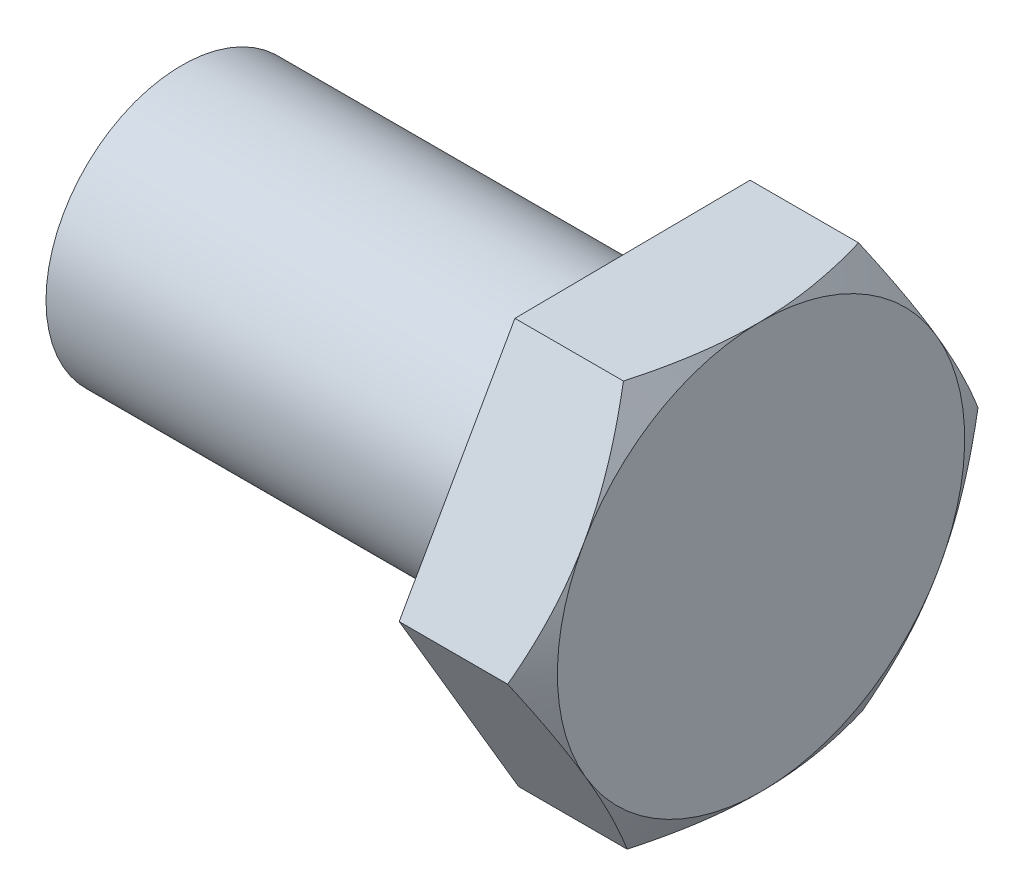
ISO-10303-21;
HEADER;
FILE_DESCRIPTION(('STEP AP214'),'2;1');
FILE_NAME('part.step','',(''),(''),'','','');
FILE_SCHEMA(('AUTOMOTIVE_DESIGN { 1 0 10303 214 1 1 1 1 }'));
ENDSEC;
DATA;
#1=APPLICATION_CONTEXT('core data for automotive mechanical design processes');
#2=APPLICATION_PROTOCOL_DEFINITION('international standard','automotive_design',2000,#1);
#3=PRODUCT_CONTEXT('',#1,'mechanical');
#4=PRODUCT('Part','Part','',(#3));
#5=PRODUCT_RELATED_PRODUCT_CATEGORY('part','',(#4));
#6=PRODUCT_DEFINITION_FORMATION('','',#4);
#7=PRODUCT_DEFINITION_CONTEXT('part definition',#1,'design');
#8=PRODUCT_DEFINITION('design','',#6,#7);
#9=PRODUCT_DEFINITION_SHAPE('','',#8);
#10=(LENGTH_UNIT() NAMED_UNIT(*) SI_UNIT(.MILLI.,.METRE.));
#11=(NAMED_UNIT(*) PLANE_ANGLE_UNIT() SI_UNIT($,.RADIAN.));
#12=(NAMED_UNIT(*) SI_UNIT($,.STERADIAN.) SOLID_ANGLE_UNIT());
#13=UNCERTAINTY_MEASURE_WITH_UNIT(LENGTH_MEASURE(1.E-05),#10,'distance_accuracy_value','');
#14=(GEOMETRIC_REPRESENTATION_CONTEXT(3) GLOBAL_UNCERTAINTY_ASSIGNED_CONTEXT((#13)) GLOBAL_UNIT_ASSIGNED_CONTEXT((#10,
#11,#12)) REPRESENTATION_CONTEXT('',''));
#15=CARTESIAN_POINT('',(0.,0.,0.));
#16=DIRECTION('',(0.,0.,1.));
#17=DIRECTION('',(1.,0.,0.));
#18=AXIS2_PLACEMENT_3D('',#15,#16,#17);
#19=CARTESIAN_POINT('',(8.89,-14.361104324196,8.1200712798324));
#20=DIRECTION('',(0.,0.999959562385626,0.00899297467729331));
#21=DIRECTION('',(0.,-0.00899297467729331,0.999959562385626));
#22=AXIS2_PLACEMENT_3D('',#19,#20,#21);
#23=PLANE('',#22);
#24=CARTESIAN_POINT('',(7.61383423316013,-14.3611061228637,8.1202712798324));
#25=CARTESIAN_POINT('',(7.71850501968246,-14.3578451386025,7.75767130465619));
#26=CARTESIAN_POINT('',(7.81842602632278,-14.3545714347515,7.39365699485442));
#27=CARTESIAN_POINT('',(8.00744820677203,-14.3479977758149,6.6627094108369));
#28=CARTESIAN_POINT('',(8.09654582196546,-14.3446978124734,6.2957752186189));
#29=CARTESIAN_POINT('',(8.26272355998788,-14.3380652570748,5.55827873587119));
#30=CARTESIAN_POINT('',(8.33977524938989,-14.3347326069787,5.1877099918014));
#31=CARTESIAN_POINT('',(8.48020660999751,-14.3280441489596,4.44399750579711));
#32=CARTESIAN_POINT('',(8.54358706117451,-14.3246883423689,4.07085391201705));
#33=CARTESIAN_POINT('',(8.65398016041535,-14.3180395597161,3.33155306547127));
#34=CARTESIAN_POINT('',(8.70135819105248,-14.3147470772623,2.96545069870061));
#35=CARTESIAN_POINT('',(8.78080058070373,-14.3081470256574,2.23156842376965));
#36=CARTESIAN_POINT('',(8.81286464495438,-14.3048394562172,1.86378848345692));
#37=CARTESIAN_POINT('',(8.86086950293414,-14.2982187611671,1.12761079337117));
#38=CARTESIAN_POINT('',(8.87682945598307,-14.2949056468681,0.75921430128303));
#39=CARTESIAN_POINT('',(8.89228286178056,-14.2882763600584,0.0220812641010718));
#40=CARTESIAN_POINT('',(8.89177682333701,-14.2849601876454,-0.346655270133182));
#41=CARTESIAN_POINT('',(8.8754484918672,-14.2787606397945,-1.03600416505861));
#42=CARTESIAN_POINT('',(8.86161786235952,-14.2758768225261,-1.3566656544101));
#43=CARTESIAN_POINT('',(8.82176488345615,-14.2701158214599,-1.99725103487098));
#44=CARTESIAN_POINT('',(8.79574167172083,-14.2672386381457,-2.31717487220018));
#45=CARTESIAN_POINT('',(8.73195725375074,-14.2614924677653,-2.95611117804943));
#46=CARTESIAN_POINT('',(8.69418635313654,-14.2586234894507,-3.2751226734641));
#47=CARTESIAN_POINT('',(8.60756923125487,-14.2528989830529,-3.9116500871133));
#48=CARTESIAN_POINT('',(8.55872225707379,-14.2500434558977,-4.22916590217813));
#49=CARTESIAN_POINT('',(8.39433244573928,-14.2413753455331,-5.19300269233215));
#50=CARTESIAN_POINT('',(8.26239833315531,-14.2355878635611,-5.83653257513115));
#51=CARTESIAN_POINT('',(7.96296199053741,-14.2240991972776,-7.11399660916556));
#52=CARTESIAN_POINT('',(7.79553008266227,-14.2183978658765,-7.74794711580104));
#53=CARTESIAN_POINT('',(7.61383423316013,-14.2127383723056,-8.37724553123608));
#54=B_SPLINE_CURVE_WITH_KNOTS('',3,(#24,#25,#26,#27,#28,#29,#30,#31,#32,#33,#34,#35,#36,#37,#38,
#39,#40,#41,#42,#43,#44,#45,#46,#47,#48,#49,#50,#51,#52,#53),.UNSPECIFIED.,.F.,.F.,(4,2,2,2,2,2,
2,2,2,2,2,2,2,2,4),(0.,1.13228761161251,2.26494650542659,3.40023984511805,4.53546839692048,
5.64267690327948,6.74990672034689,7.855817689607,8.96169448566309,9.92438012734376,
10.8871338667672,11.8506842032912,12.8143000583182,14.7839071099558,16.7496481748106),.UNSPECIFIED.);
#55=CARTESIAN_POINT('',(7.61389197104679,-14.361104324196,8.1200712798324));
#56=VERTEX_POINT('',#55);
#57=CARTESIAN_POINT('',(8.89,-14.2869222475846,-0.128487125701828));
#58=VERTEX_POINT('',#57);
#59=EDGE_CURVE('E201',#56,#58,#54,.T.);
#60=ORIENTED_EDGE('',*,*,#59,.F.);
#61=DIRECTION('',(-1.,0.,0.));
#62=VECTOR('',#61,1.);
#63=CARTESIAN_POINT('',(8.89,-14.361104324196,8.1200712798324));
#64=LINE('',#63,#62);
#65=CARTESIAN_POINT('',(0.,-14.361104324196,8.1200712798324));
#66=VERTEX_POINT('',#65);
#67=EDGE_CURVE('E204',#56,#66,#64,.T.);
#68=ORIENTED_EDGE('',*,*,#67,.T.);
#69=DIRECTION('',(0.,0.00899297467729331,-0.999959562385626));
#70=VECTOR('',#69,1.);
#71=CARTESIAN_POINT('',(0.,-14.361104324196,8.1200712798324));
#72=LINE('',#71,#70);
#73=CARTESIAN_POINT('',(0.,-14.2127401709733,-8.37704553123608));
#74=VERTEX_POINT('',#73);
#75=EDGE_CURVE('E208',#66,#74,#72,.T.);
#76=ORIENTED_EDGE('',*,*,#75,.T.);
#77=DIRECTION('',(-1.,0.,0.));
#78=VECTOR('',#77,1.);
#79=CARTESIAN_POINT('',(8.89,-14.2127401709733,-8.37704553123608));
#80=LINE('',#79,#78);
#81=CARTESIAN_POINT('',(7.61389197104678,-14.2127401709733,-8.37704553123608));
#82=VERTEX_POINT('',#81);
#83=EDGE_CURVE('E225',#82,#74,#80,.T.);
#84=ORIENTED_EDGE('',*,*,#83,.F.);
#85=EDGE_CURVE('E166',#58,#82,#54,.T.);
#86=ORIENTED_EDGE('',*,*,#85,.F.);
#87=EDGE_LOOP('',(#60,#68,#76,#84,#86));
#88=FACE_BOUND('',#87,.T.);
#89=ADVANCED_FACE('F34',(#88),#23,.F.);
#90=CARTESIAN_POINT('',(8.89,-14.2127401709733,-8.37704553123608));
#91=DIRECTION('',(0.,0.492191636666687,0.870486871121769));
#92=DIRECTION('',(0.,-0.870486871121769,0.492191636666687));
#93=AXIS2_PLACEMENT_3D('',#90,#91,#92);
#94=PLANE('',#93);
#95=CARTESIAN_POINT('',(7.61382564537104,-14.2129401709733,-8.37693244701781));
#96=CARTESIAN_POINT('',(7.71849678706554,-13.897288670829,-8.55540846271248));
#97=CARTESIAN_POINT('',(7.81841815770088,-13.5804059601771,-8.73458063079598));
#98=CARTESIAN_POINT('',(8.00744108189913,-12.9440995114158,-9.09436171748121));
#99=CARTESIAN_POINT('',(8.09653907685036,-12.6246749741633,-9.27497108793521));
#100=CARTESIAN_POINT('',(8.26271759076352,-11.9826675454617,-9.63797562891999));
#101=CARTESIAN_POINT('',(8.33976967605511,-11.6600790359932,-9.82037397599733));
#102=CARTESIAN_POINT('',(8.48020183701944,-11.0126604148762,-10.1864381193031));
#103=CARTESIAN_POINT('',(8.54358269266448,-10.6878304322001,-10.3701038426077));
#104=CARTESIAN_POINT('',(8.65397658787733,-10.0442522531112,-10.7339965189906));
#105=CARTESIAN_POINT('',(8.70135501124461,-9.72555183663829,-10.9141964562832));
#106=CARTESIAN_POINT('',(8.78079818273625,-9.08669065338645,-11.2754220437322));
#107=CARTESIAN_POINT('',(8.81286263610149,-8.76652985861831,-11.4564477097142));
#108=CARTESIAN_POINT('',(8.86086825852459,-8.12567044066642,-11.818803141208));
#109=CARTESIAN_POINT('',(8.87682858705855,-7.80497291235072,-12.0001322876582));
#110=CARTESIAN_POINT('',(8.89228272109854,-7.16328181750311,-12.36295796681));
#111=CARTESIAN_POINT('',(8.89177703540114,-6.84228826042491,-12.5444544941663));
#112=CARTESIAN_POINT('',(8.87544928801941,-6.24219264318441,-12.8837612129747));
#113=CARTESIAN_POINT('',(8.86161881875123,-5.96304781864989,-13.0415955843048));
#114=CARTESIAN_POINT('',(8.82176598665481,-5.4054002671568,-13.3569012714531));
#115=CARTESIAN_POINT('',(8.79574276145702,-5.12689758701621,-13.5143725607992));
#116=CARTESIAN_POINT('',(8.73195814947957,-4.57068559756827,-13.8288665508892));
#117=CARTESIAN_POINT('',(8.69418706797525,-4.29297713539762,-13.985888772644));
#118=CARTESIAN_POINT('',(8.60756942963421,-3.73886216089466,-14.2991970662552));
#119=CARTESIAN_POINT('',(8.55872211986204,-3.46245573837638,-14.4554830873289));
#120=CARTESIAN_POINT('',(8.39433105325746,-2.62340868196375,-14.9298979896512));
#121=CARTESIAN_POINT('',(8.26239579165948,-2.06319779148574,-15.2466530427257));
#122=CARTESIAN_POINT('',(7.96295671438252,-0.951129439744096,-15.875439943812));
#123=CARTESIAN_POINT('',(7.79552322303081,-0.399257740274698,-16.1874798424056));
#124=CARTESIAN_POINT('',(7.61382564537104,0.148564153222704,-16.4972298952868));
#125=B_SPLINE_CURVE_WITH_KNOTS('',3,(#95,#96,#97,#98,#99,#100,#101,#102,#103,#104,#105,#106,
#107,#108,#109,#110,#111,#112,#113,#114,#115,#116,#117,#118,#119,#120,#121,#122,#123,#124),
.UNSPECIFIED.,.F.,.F.,(4,2,2,2,2,2,2,2,2,2,2,2,2,2,4),(0.,1.13228862938317,2.26494854143682,
3.40024292719027,4.5354725248775,5.64268195247061,6.74991269047001,7.85582456987814,
8.96170227686276,9.92439450375218,10.8871548302417,11.8507117763218,12.8143342423406,
14.7839552075592,16.7497100873473),.UNSPECIFIED.);
#126=CARTESIAN_POINT('',(8.89,-7.03218800887529,-12.4370811711523));
#127=VERTEX_POINT('',#126);
#128=EDGE_CURVE('E251',#82,#127,#125,.T.);
#129=ORIENTED_EDGE('',*,*,#128,.F.);
#130=ORIENTED_EDGE('',*,*,#83,.T.);
#131=DIRECTION('',(0.,0.870486871121769,-0.492191636666687));
#132=VECTOR('',#131,1.);
#133=CARTESIAN_POINT('',(0.,-14.2127401709733,-8.37704553123608));
#134=LINE('',#133,#132);
#135=CARTESIAN_POINT('',(0.,0.148364153222704,-16.4971168110685));
#136=VERTEX_POINT('',#135);
#137=EDGE_CURVE('E241',#74,#136,#134,.T.);
#138=ORIENTED_EDGE('',*,*,#137,.T.);
#139=DIRECTION('',(-1.,0.,0.));
#140=VECTOR('',#139,1.);
#141=CARTESIAN_POINT('',(8.89,0.148364153222704,-16.4971168110685));
#142=LINE('',#141,#140);
#143=CARTESIAN_POINT('',(7.61389197104678,0.148364153222704,-16.4971168110685));
#144=VERTEX_POINT('',#143);
#145=EDGE_CURVE('E224',#144,#136,#142,.T.);
#146=ORIENTED_EDGE('',*,*,#145,.F.);
#147=EDGE_CURVE('E252',#127,#144,#125,.T.);
#148=ORIENTED_EDGE('',*,*,#147,.F.);
#149=EDGE_LOOP('',(#129,#130,#138,#146,#148));
#150=FACE_BOUND('',#149,.T.);
#151=ADVANCED_FACE('F193',(#150),#94,.F.);
#152=CARTESIAN_POINT('',(8.89,0.148364153222704,-16.4971168110685));
#153=DIRECTION('',(0.,-0.50776792571894,0.861493896444476));
#154=DIRECTION('',(0.,-0.861493896444476,-0.50776792571894));
#155=AXIS2_PLACEMENT_3D('',#152,#153,#154);
#156=PLANE('',#155);
#157=CARTESIAN_POINT('',(7.61382495300233,0.148164153222704,-16.4972346918632));
#158=CARTESIAN_POINT('',(7.71849612333163,0.460554684254756,-16.313110471586));
#159=CARTESIAN_POINT('',(7.81841752331311,0.77416370627378,-16.1282680678794));
#160=CARTESIAN_POINT('',(8.00744050747413,1.40389652684779,-15.7571010411835));
#161=CARTESIAN_POINT('',(8.09653853304232,1.72002111628993,-15.5707759520421));
#162=CARTESIAN_POINT('',(8.26271710950959,2.35539602166479,-15.1962834581456));
#163=CARTESIAN_POINT('',(8.33976922671872,2.67465189758276,-15.0081127763132));
#164=CARTESIAN_POINT('',(8.48020145220968,3.31538209444563,-14.6304638523344));
#165=CARTESIAN_POINT('',(8.54358234046389,3.63685628775038,-14.4409856854197));
#166=CARTESIAN_POINT('',(8.65397629984987,4.273785717083,-14.0655769489256));
#167=CARTESIAN_POINT('',(8.70135475487998,4.58919366674677,-13.8796742501172));
#168=CARTESIAN_POINT('',(8.78079798940543,5.22145483062053,-13.5070170078339));
#169=CARTESIAN_POINT('',(8.81286247414201,5.53830807253058,-13.3202624480327));
#170=CARTESIAN_POINT('',(8.86086815819635,6.17254682940552,-12.9464396045766));
#171=CARTESIAN_POINT('',(8.87682851700279,6.48993126081136,-12.7593719595758));
#172=CARTESIAN_POINT('',(8.89228270975544,7.12499310463946,-12.3850639853989));
#173=CARTESIAN_POINT('',(8.89177705249727,7.44267050770565,-12.1978236617374));
#174=CARTESIAN_POINT('',(8.87544935220629,8.03656672908704,-11.8477788690027));
#175=CARTESIAN_POINT('',(8.86161889585715,8.31282786972077,-11.6849494549867));
#176=CARTESIAN_POINT('',(8.82176607559689,8.86471468674218,-11.3596651721066));
#177=CARTESIAN_POINT('',(8.79574284931383,9.14034031679546,-11.197210330552));
#178=CARTESIAN_POINT('',(8.73195822169521,9.69080640202732,-10.8727634326339));
#179=CARTESIAN_POINT('',(8.69418712560715,9.9656460188188,-10.710771870419));
#180=CARTESIAN_POINT('',(8.60756944562799,10.5140367516218,-10.3875481934689));
#181=CARTESIAN_POINT('',(8.55872210879968,10.7875877787469,-10.2263161311236));
#182=CARTESIAN_POINT('',(8.39433094099221,11.6179671315336,-9.73688724107054));
#183=CARTESIAN_POINT('',(8.26239558675789,12.1723908125177,-9.41010772049048));
#184=CARTESIAN_POINT('',(7.96295628900594,13.2729710336885,-8.76142136496596));
#185=CARTESIAN_POINT('',(7.79552266999043,13.8191416650239,-8.43950622464247));
#186=CARTESIAN_POINT('',(7.61382495300234,14.361304324196,-8.11995339903771));
#187=B_SPLINE_CURVE_WITH_KNOTS('',3,(#157,#158,#159,#160,#161,#162,#163,#164,#165,#166,#167,
#168,#169,#170,#171,#172,#173,#174,#175,#176,#177,#178,#179,#180,#181,#182,#183,#184,#185,#186),
.UNSPECIFIED.,.F.,.F.,(4,2,2,2,2,2,2,2,2,2,2,2,2,2,4),(0.,1.13228871143834,2.26494870558497,
3.4002431756745,4.53547285768353,5.64268235954881,6.74991317179602,7.85582512458252,
8.96170290500844,9.92439566281272,10.8871565203669,11.8507139993248,12.8143369983372,
14.7839590853013,16.7497150788817),.UNSPECIFIED.);
#188=CARTESIAN_POINT('',(8.89,7.25473423870935,-12.3085940454504));
#189=VERTEX_POINT('',#188);
#190=EDGE_CURVE('E250',#144,#189,#187,.T.);
#191=ORIENTED_EDGE('',*,*,#190,.F.);
#192=ORIENTED_EDGE('',*,*,#145,.T.);
#193=DIRECTION('',(0.,0.861493896444476,0.50776792571894));
#194=VECTOR('',#193,1.);
#195=CARTESIAN_POINT('',(0.,0.148364153222704,-16.4971168110685));
#196=LINE('',#195,#194);
#197=CARTESIAN_POINT('',(0.,14.361104324196,-8.12007127983241));
#198=VERTEX_POINT('',#197);
#199=EDGE_CURVE('E242',#136,#198,#196,.T.);
#200=ORIENTED_EDGE('',*,*,#199,.T.);
#201=DIRECTION('',(-1.,0.,0.));
#202=VECTOR('',#201,1.);
#203=CARTESIAN_POINT('',(8.89,14.361104324196,-8.12007127983241));
#204=LINE('',#203,#202);
#205=CARTESIAN_POINT('',(7.61389197104679,14.361104324196,-8.12007127983241));
#206=VERTEX_POINT('',#205);
#207=EDGE_CURVE('E222',#206,#198,#204,.T.);
#208=ORIENTED_EDGE('',*,*,#207,.F.);
#209=EDGE_CURVE('E111',#189,#206,#187,.T.);
#210=ORIENTED_EDGE('',*,*,#209,.F.);
#211=EDGE_LOOP('',(#191,#192,#200,#208,#210));
#212=FACE_BOUND('',#211,.T.);
#213=ADVANCED_FACE('F191',(#212),#156,.F.);
#214=CARTESIAN_POINT('',(8.89,14.361104324196,-8.12007127983241));
#215=DIRECTION('',(0.,-0.999959562385626,-0.00899297467729352));
#216=DIRECTION('',(0.,0.00899297467729352,-0.999959562385626));
#217=AXIS2_PLACEMENT_3D('',#214,#215,#216);
#218=PLANE('',#217);
#219=CARTESIAN_POINT('',(7.61383423316013,14.3611061228637,-8.12027127983241));
#220=CARTESIAN_POINT('',(7.71850501968246,14.3578451386025,-7.7576713046562));
#221=CARTESIAN_POINT('',(7.81842602632277,14.3545714347515,-7.39365699485443));
#222=CARTESIAN_POINT('',(8.00744820677202,14.3479977758149,-6.66270941083691));
#223=CARTESIAN_POINT('',(8.09654582196546,14.3446978124734,-6.29577521861891));
#224=CARTESIAN_POINT('',(8.26272355998788,14.3380652570748,-5.5582787358712));
#225=CARTESIAN_POINT('',(8.33977524938989,14.3347326069787,-5.18770999180142));
#226=CARTESIAN_POINT('',(8.48020660999751,14.3280441489596,-4.44399750579712));
#227=CARTESIAN_POINT('',(8.54358706117451,14.3246883423689,-4.07085391201706));
#228=CARTESIAN_POINT('',(8.65398016041535,14.3180395597161,-3.33155306547128));
#229=CARTESIAN_POINT('',(8.70135819105248,14.3147470772623,-2.96545069870062));
#230=CARTESIAN_POINT('',(8.78080058070373,14.3081470256574,-2.23156842376966));
#231=CARTESIAN_POINT('',(8.81286464495438,14.3048394562172,-1.86378848345693));
#232=CARTESIAN_POINT('',(8.86086950293414,14.2982187611671,-1.12761079337118));
#233=CARTESIAN_POINT('',(8.87682945598307,14.2949056468681,-0.759214301283041));
#234=CARTESIAN_POINT('',(8.89228286178056,14.2882763600584,-0.0220812641010824));
#235=CARTESIAN_POINT('',(8.89177682333701,14.2849601876453,0.346655270133171));
#236=CARTESIAN_POINT('',(8.8754484918672,14.2787606397945,1.0360041650586));
#237=CARTESIAN_POINT('',(8.86161786235953,14.2758768225261,1.35666565441009));
#238=CARTESIAN_POINT('',(8.82176488345616,14.2701158214599,1.99725103487097));
#239=CARTESIAN_POINT('',(8.79574167172083,14.2672386381457,2.31717487220017));
#240=CARTESIAN_POINT('',(8.73195725375075,14.2614924677653,2.95611117804942));
#241=CARTESIAN_POINT('',(8.69418635313655,14.2586234894507,3.27512267346409));
#242=CARTESIAN_POINT('',(8.60756923125487,14.2528989830529,3.91165008711329));
#243=CARTESIAN_POINT('',(8.55872225707379,14.2500434558977,4.22916590217812));
#244=CARTESIAN_POINT('',(8.39433244573928,14.2413753455331,5.19300269233214));
#245=CARTESIAN_POINT('',(8.26239833315531,14.2355878635611,5.83653257513114));
#246=CARTESIAN_POINT('',(7.96296199053741,14.2240991972776,7.11399660916555));
#247=CARTESIAN_POINT('',(7.79553008266227,14.2183978658765,7.74794711580103));
#248=CARTESIAN_POINT('',(7.61383423316013,14.2127383723056,8.37724553123607));
#249=B_SPLINE_CURVE_WITH_KNOTS('',3,(#219,#220,#221,#222,#223,#224,#225,#226,#227,#228,#229,
#230,#231,#232,#233,#234,#235,#236,#237,#238,#239,#240,#241,#242,#243,#244,#245,#246,#247,#248),
.UNSPECIFIED.,.F.,.F.,(4,2,2,2,2,2,2,2,2,2,2,2,2,2,4),(0.,1.13228761161251,2.26494650542659,
3.40023984511805,4.53546839692048,5.64267690327948,6.74990672034689,7.855817689607,
8.96169448566309,9.92438012734376,10.8871338667672,11.8506842032912,12.8143000583182,
14.7839071099558,16.7496481748106),.UNSPECIFIED.);
#250=CARTESIAN_POINT('',(8.89,14.2869222475846,0.128487125701831));
#251=VERTEX_POINT('',#250);
#252=EDGE_CURVE('E107',#206,#251,#249,.T.);
#253=ORIENTED_EDGE('',*,*,#252,.F.);
#254=ORIENTED_EDGE('',*,*,#207,.T.);
#255=DIRECTION('',(0.,-0.00899297467729352,0.999959562385626));
#256=VECTOR('',#255,1.);
#257=CARTESIAN_POINT('',(0.,14.361104324196,-8.12007127983241));
#258=LINE('',#257,#256);
#259=CARTESIAN_POINT('',(0.,14.2127401709733,8.37704553123607));
#260=VERTEX_POINT('',#259);
#261=EDGE_CURVE('E239',#198,#260,#258,.T.);
#262=ORIENTED_EDGE('',*,*,#261,.T.);
#263=DIRECTION('',(-1.,0.,0.));
#264=VECTOR('',#263,1.);
#265=CARTESIAN_POINT('',(8.89,14.2127401709733,8.37704553123607));
#266=LINE('',#265,#264);
#267=CARTESIAN_POINT('',(7.61389197104679,14.2127401709733,8.37704553123607));
#268=VERTEX_POINT('',#267);
#269=EDGE_CURVE('E132',#268,#260,#266,.T.);
#270=ORIENTED_EDGE('',*,*,#269,.F.);
#271=EDGE_CURVE('E115',#251,#268,#249,.T.);
#272=ORIENTED_EDGE('',*,*,#271,.F.);
#273=EDGE_LOOP('',(#253,#254,#262,#270,#272));
#274=FACE_BOUND('',#273,.T.);
#275=ADVANCED_FACE('F130',(#274),#218,.F.);
#276=CARTESIAN_POINT('',(8.89,14.2127401709733,8.37704553123607));
#277=DIRECTION('',(0.,-0.492191636666687,-0.870486871121769));
#278=DIRECTION('',(0.,0.87048687112177,-0.492191636666687));
#279=AXIS2_PLACEMENT_3D('',#276,#277,#278);
#280=PLANE('',#279);
#281=CARTESIAN_POINT('',(7.61382564537105,14.2129401709733,8.3769324470178));
#282=CARTESIAN_POINT('',(7.71849678706554,13.8972886708289,8.55540846271247));
#283=CARTESIAN_POINT('',(7.81841815770089,13.5804059601771,8.73458063079597));
#284=CARTESIAN_POINT('',(8.00744108189914,12.9440995114158,9.0943617174812));
#285=CARTESIAN_POINT('',(8.09653907685037,12.6246749741633,9.2749710879352));
#286=CARTESIAN_POINT('',(8.26271759076352,11.9826675454617,9.63797562891997));
#287=CARTESIAN_POINT('',(8.33976967605511,11.6600790359932,9.82037397599732));
#288=CARTESIAN_POINT('',(8.48020183701944,11.0126604148762,10.1864381193031));
#289=CARTESIAN_POINT('',(8.54358269266449,10.6878304322001,10.3701038426077));
#290=CARTESIAN_POINT('',(8.65397658787734,10.0442522531112,10.7339965189906));
#291=CARTESIAN_POINT('',(8.70135501124462,9.72555183663829,10.9141964562832));
#292=CARTESIAN_POINT('',(8.78079818273626,9.08669065338645,11.2754220437322));
#293=CARTESIAN_POINT('',(8.8128626361015,8.76652985861831,11.4564477097142));
#294=CARTESIAN_POINT('',(8.8608682585246,8.12567044066642,11.818803141208));
#295=CARTESIAN_POINT('',(8.87682858705855,7.80497291235072,12.0001322876582));
#296=CARTESIAN_POINT('',(8.89228272109855,7.16328181750311,12.36295796681));
#297=CARTESIAN_POINT('',(8.89177703540115,6.84228826042491,12.5444544941662));
#298=CARTESIAN_POINT('',(8.87544928801942,6.2421926431844,12.8837612129746));
#299=CARTESIAN_POINT('',(8.86161881875124,5.96304781864989,13.0415955843048));
#300=CARTESIAN_POINT('',(8.82176598665482,5.4054002671568,13.356901271453));
#301=CARTESIAN_POINT('',(8.79574276145703,5.12689758701621,13.5143725607992));
#302=CARTESIAN_POINT('',(8.73195814947958,4.57068559756827,13.8288665508892));
#303=CARTESIAN_POINT('',(8.69418706797526,4.29297713539761,13.985888772644));
#304=CARTESIAN_POINT('',(8.60756942963422,3.73886216089465,14.2991970662552));
#305=CARTESIAN_POINT('',(8.55872211986205,3.46245573837638,14.4554830873289));
#306=CARTESIAN_POINT('',(8.39433105325747,2.62340868196375,14.9298979896512));
#307=CARTESIAN_POINT('',(8.26239579165948,2.06319779148574,15.2466530427257));
#308=CARTESIAN_POINT('',(7.96295671438252,0.951129439744094,15.875439943812));
#309=CARTESIAN_POINT('',(7.79552322303081,0.399257740274696,16.1874798424056));
#310=CARTESIAN_POINT('',(7.61382564537105,-0.148564153222705,16.4972298952867));
#311=B_SPLINE_CURVE_WITH_KNOTS('',3,(#281,#282,#283,#284,#285,#286,#287,#288,#289,#290,#291,
#292,#293,#294,#295,#296,#297,#298,#299,#300,#301,#302,#303,#304,#305,#306,#307,#308,#309,#310),
.UNSPECIFIED.,.F.,.F.,(4,2,2,2,2,2,2,2,2,2,2,2,2,2,4),(0.,1.13228862938316,2.26494854143682,
3.40024292719027,4.53547252487749,5.6426819524706,6.74991269047,7.85582456987814,
8.96170227686275,9.92439450375217,10.8871548302417,11.8507117763218,12.8143342423406,
14.7839552075592,16.7497100873473),.UNSPECIFIED.);
#312=CARTESIAN_POINT('',(8.89,7.03218800887529,12.4370811711523));
#313=VERTEX_POINT('',#312);
#314=EDGE_CURVE('E120',#268,#313,#311,.T.);
#315=ORIENTED_EDGE('',*,*,#314,.F.);
#316=ORIENTED_EDGE('',*,*,#269,.T.);
#317=DIRECTION('',(0.,-0.87048687112177,0.492191636666687));
#318=VECTOR('',#317,1.);
#319=CARTESIAN_POINT('',(0.,14.2127401709733,8.37704553123607));
#320=LINE('',#319,#318);
#321=CARTESIAN_POINT('',(0.,-0.148364153222706,16.4971168110685));
#322=VERTEX_POINT('',#321);
#323=EDGE_CURVE('E217',#260,#322,#320,.T.);
#324=ORIENTED_EDGE('',*,*,#323,.T.);
#325=DIRECTION('',(-1.,0.,0.));
#326=VECTOR('',#325,1.);
#327=CARTESIAN_POINT('',(8.89,-0.148364153222706,16.4971168110685));
#328=LINE('',#327,#326);
#329=CARTESIAN_POINT('',(7.61389197104679,-0.148364153222706,16.4971168110685));
#330=VERTEX_POINT('',#329);
#331=EDGE_CURVE('E214',#330,#322,#328,.T.);
#332=ORIENTED_EDGE('',*,*,#331,.F.);
#333=EDGE_CURVE('E133',#313,#330,#311,.T.);
#334=ORIENTED_EDGE('',*,*,#333,.F.);
#335=EDGE_LOOP('',(#315,#316,#324,#332,#334));
#336=FACE_BOUND('',#335,.T.);
#337=ADVANCED_FACE('F183',(#336),#280,.F.);
#338=CARTESIAN_POINT('',(8.89,-0.148364153222706,16.4971168110685));
#339=DIRECTION('',(0.,0.507767925718939,-0.861493896444476));
#340=DIRECTION('',(0.,0.861493896444476,0.50776792571894));
#341=AXIS2_PLACEMENT_3D('',#338,#339,#340);
#342=PLANE('',#341);
#343=CARTESIAN_POINT('',(7.61382495300234,-0.148164153222706,16.4972346918632));
#344=CARTESIAN_POINT('',(7.71849612333164,-0.460554684254759,16.313110471586));
#345=CARTESIAN_POINT('',(7.81841752331311,-0.774163706273783,16.1282680678794));
#346=CARTESIAN_POINT('',(8.00744050747414,-1.40389652684779,15.7571010411835));
#347=CARTESIAN_POINT('',(8.09653853304233,-1.72002111628994,15.5707759520421));
#348=CARTESIAN_POINT('',(8.2627171095096,-2.35539602166479,15.1962834581456));
#349=CARTESIAN_POINT('',(8.33976922671873,-2.67465189758276,15.0081127763132));
#350=CARTESIAN_POINT('',(8.48020145220969,-3.31538209444563,14.6304638523344));
#351=CARTESIAN_POINT('',(8.5435823404639,-3.63685628775038,14.4409856854197));
#352=CARTESIAN_POINT('',(8.65397629984988,-4.273785717083,14.0655769489256));
#353=CARTESIAN_POINT('',(8.70135475487999,-4.58919366674677,13.8796742501172));
#354=CARTESIAN_POINT('',(8.78079798940544,-5.22145483062053,13.5070170078339));
#355=CARTESIAN_POINT('',(8.81286247414201,-5.53830807253058,13.3202624480326));
#356=CARTESIAN_POINT('',(8.86086815819635,-6.17254682940551,12.9464396045766));
#357=CARTESIAN_POINT('',(8.8768285170028,-6.48993126081136,12.7593719595758));
#358=CARTESIAN_POINT('',(8.89228270975545,-7.12499310463946,12.3850639853989));
#359=CARTESIAN_POINT('',(8.89177705249728,-7.44267050770565,12.1978236617374));
#360=CARTESIAN_POINT('',(8.87544935220629,-8.03656672908704,11.8477788690026));
#361=CARTESIAN_POINT('',(8.86161889585715,-8.31282786972077,11.6849494549867));
#362=CARTESIAN_POINT('',(8.8217660755969,-8.86471468674218,11.3596651721066));
#363=CARTESIAN_POINT('',(8.79574284931384,-9.14034031679546,11.197210330552));
#364=CARTESIAN_POINT('',(8.73195822169521,-9.69080640202731,10.8727634326339));
#365=CARTESIAN_POINT('',(8.69418712560715,-9.96564601881879,10.710771870419));
#366=CARTESIAN_POINT('',(8.60756944562799,-10.5140367516218,10.3875481934689));
#367=CARTESIAN_POINT('',(8.55872210879969,-10.7875877787469,10.2263161311236));
#368=CARTESIAN_POINT('',(8.39433094099222,-11.6179671315336,9.73688724107053));
#369=CARTESIAN_POINT('',(8.26239558675789,-12.1723908125177,9.41010772049047));
#370=CARTESIAN_POINT('',(7.96295628900595,-13.2729710336885,8.76142136496595));
#371=CARTESIAN_POINT('',(7.79552266999043,-13.8191416650239,8.43950622464246));
#372=CARTESIAN_POINT('',(7.61382495300234,-14.361304324196,8.1199533990377));
#373=B_SPLINE_CURVE_WITH_KNOTS('',3,(#343,#344,#345,#346,#347,#348,#349,#350,#351,#352,#353,
#354,#355,#356,#357,#358,#359,#360,#361,#362,#363,#364,#365,#366,#367,#368,#369,#370,#371,#372),
.UNSPECIFIED.,.F.,.F.,(4,2,2,2,2,2,2,2,2,2,2,2,2,2,4),(0.,1.13228871143833,2.26494870558496,
3.4002431756745,4.53547285768353,5.6426823595488,6.74991317179601,7.85582512458252,
8.96170290500843,9.92439566281271,10.8871565203669,11.8507139993248,12.8143369983372,
14.7839590853013,16.7497150788817),.UNSPECIFIED.);
#374=CARTESIAN_POINT('',(8.89,-7.25473423870934,12.3085940454504));
#375=VERTEX_POINT('',#374);
#376=EDGE_CURVE('E178',#330,#375,#373,.T.);
#377=ORIENTED_EDGE('',*,*,#376,.F.);
#378=ORIENTED_EDGE('',*,*,#331,.T.);
#379=DIRECTION('',(0.,-0.861493896444476,-0.507767925718939));
#380=VECTOR('',#379,1.);
#381=CARTESIAN_POINT('',(0.,-0.148364153222706,16.4971168110685));
#382=LINE('',#381,#380);
#383=EDGE_CURVE('E212',#322,#66,#382,.T.);
#384=ORIENTED_EDGE('',*,*,#383,.T.);
#385=ORIENTED_EDGE('',*,*,#67,.F.);
#386=EDGE_CURVE('E126',#375,#56,#373,.T.);
#387=ORIENTED_EDGE('',*,*,#386,.F.);
#388=EDGE_LOOP('',(#377,#378,#384,#385,#387));
#389=FACE_BOUND('',#388,.T.);
#390=ADVANCED_FACE('F179',(#389),#342,.F.);
#391=CARTESIAN_POINT('',(0.,0.,0.));
#392=DIRECTION('',(1.,0.,0.));
#393=DIRECTION('',(0.,0.,-1.));
#394=AXIS2_PLACEMENT_3D('',#391,#392,#393);
#395=PLANE('',#394);
#396=CARTESIAN_POINT('',(0.,0.,0.));
#397=DIRECTION('',(-1.,0.,0.));
#398=DIRECTION('',(0.,0.,1.));
#399=AXIS2_PLACEMENT_3D('',#396,#397,#398);
#400=CIRCLE('',#399,9.525);
#401=CARTESIAN_POINT('',(0.,0.,9.525));
#402=VERTEX_POINT('',#401);
#403=EDGE_CURVE('E12',#402,#402,#400,.T.);
#404=ORIENTED_EDGE('',*,*,#403,.F.);
#405=EDGE_LOOP('',(#404));
#406=FACE_BOUND('',#405,.T.);
#407=ORIENTED_EDGE('',*,*,#75,.F.);
#408=ORIENTED_EDGE('',*,*,#383,.F.);
#409=ORIENTED_EDGE('',*,*,#323,.F.);
#410=ORIENTED_EDGE('',*,*,#261,.F.);
#411=ORIENTED_EDGE('',*,*,#199,.F.);
#412=ORIENTED_EDGE('',*,*,#137,.F.);
#413=EDGE_LOOP('',(#407,#408,#409,#410,#411,#412));
#414=FACE_BOUND('',#413,.T.);
#415=ADVANCED_FACE('F182',(#406,#414),#395,.F.);
#416=CARTESIAN_POINT('',(8.89,0.,0.));
#417=DIRECTION('',(-1.,0.,0.));
#418=DIRECTION('',(0.,0.,-1.));
#419=AXIS2_PLACEMENT_3D('',#416,#417,#418);
#420=CONICAL_SURFACE('',#419,14.2875,1.0471975511966);
#421=ORIENTED_EDGE('',*,*,#147,.T.);
#422=ORIENTED_EDGE('',*,*,#190,.T.);
#423=CARTESIAN_POINT('',(8.89,0.,0.));
#424=DIRECTION('',(1.,0.,0.));
#425=DIRECTION('',(0.,0.,-1.));
#426=AXIS2_PLACEMENT_3D('',#423,#424,#425);
#427=CIRCLE('',#426,14.2875);
#428=EDGE_CURVE('E38',#127,#189,#427,.T.);
#429=ORIENTED_EDGE('',*,*,#428,.F.);
#430=EDGE_LOOP('',(#421,#422,#429));
#431=FACE_BOUND('',#430,.T.);
#432=ADVANCED_FACE('F285',(#431),#420,.T.);
#433=ORIENTED_EDGE('',*,*,#85,.T.);
#434=ORIENTED_EDGE('',*,*,#128,.T.);
#435=EDGE_CURVE('E229',#58,#127,#427,.T.);
#436=ORIENTED_EDGE('',*,*,#435,.F.);
#437=EDGE_LOOP('',(#433,#434,#436));
#438=FACE_BOUND('',#437,.T.);
#439=ADVANCED_FACE('F158',(#438),#420,.T.);
#440=ORIENTED_EDGE('',*,*,#59,.T.);
#441=EDGE_CURVE('E230',#375,#58,#427,.T.);
#442=ORIENTED_EDGE('',*,*,#441,.F.);
#443=ORIENTED_EDGE('',*,*,#386,.T.);
#444=EDGE_LOOP('',(#440,#442,#443));
#445=FACE_BOUND('',#444,.T.);
#446=ADVANCED_FACE('F152',(#445),#420,.T.);
#447=ORIENTED_EDGE('',*,*,#333,.T.);
#448=ORIENTED_EDGE('',*,*,#376,.T.);
#449=EDGE_CURVE('E59',#313,#375,#427,.T.);
#450=ORIENTED_EDGE('',*,*,#449,.F.);
#451=EDGE_LOOP('',(#447,#448,#450));
#452=FACE_BOUND('',#451,.T.);
#453=ADVANCED_FACE('F157',(#452),#420,.T.);
#454=ORIENTED_EDGE('',*,*,#271,.T.);
#455=ORIENTED_EDGE('',*,*,#314,.T.);
#456=EDGE_CURVE('E43',#251,#313,#427,.T.);
#457=ORIENTED_EDGE('',*,*,#456,.F.);
#458=EDGE_LOOP('',(#454,#455,#457));
#459=FACE_BOUND('',#458,.T.);
#460=ADVANCED_FACE('F118',(#459),#420,.T.);
#461=ORIENTED_EDGE('',*,*,#209,.T.);
#462=ORIENTED_EDGE('',*,*,#252,.T.);
#463=CARTESIAN_POINT('',(8.89,0.,0.));
#464=DIRECTION('',(1.,0.,0.));
#465=DIRECTION('',(0.,0.,-1.));
#466=AXIS2_PLACEMENT_3D('',#463,#464,#465);
#467=CIRCLE('',#466,14.2875);
#468=EDGE_CURVE('E51',#189,#251,#467,.T.);
#469=ORIENTED_EDGE('',*,*,#468,.F.);
#470=EDGE_LOOP('',(#461,#462,#469));
#471=FACE_BOUND('',#470,.T.);
#472=ADVANCED_FACE('F109',(#471),#420,.T.);
#473=CARTESIAN_POINT('',(8.89,0.,0.));
#474=DIRECTION('',(1.,0.,0.));
#475=DIRECTION('',(0.,0.,-1.));
#476=AXIS2_PLACEMENT_3D('',#473,#474,#475);
#477=PLANE('',#476);
#478=ORIENTED_EDGE('',*,*,#428,.T.);
#479=ORIENTED_EDGE('',*,*,#468,.T.);
#480=ORIENTED_EDGE('',*,*,#456,.T.);
#481=ORIENTED_EDGE('',*,*,#449,.T.);
#482=ORIENTED_EDGE('',*,*,#441,.T.);
#483=ORIENTED_EDGE('',*,*,#435,.T.);
#484=EDGE_LOOP('',(#478,#479,#480,#481,#482,#483));
#485=FACE_BOUND('',#484,.T.);
#486=ADVANCED_FACE('F123',(#485),#477,.T.);
#487=CARTESIAN_POINT('',(-31.75,0.,0.));
#488=DIRECTION('',(1.,0.,0.));
#489=DIRECTION('',(0.,0.,-1.));
#490=AXIS2_PLACEMENT_3D('',#487,#488,#489);
#491=CYLINDRICAL_SURFACE('',#490,9.525);
#492=CARTESIAN_POINT('',(-31.75,0.,0.));
#493=DIRECTION('',(-1.,0.,0.));
#494=DIRECTION('',(0.,0.,1.));
#495=AXIS2_PLACEMENT_3D('',#492,#493,#494);
#496=CIRCLE('',#495,9.525);
#497=CARTESIAN_POINT('',(-31.75,0.,9.525));
#498=VERTEX_POINT('',#497);
#499=EDGE_CURVE('E127',#498,#498,#496,.T.);
#500=ORIENTED_EDGE('',*,*,#499,.F.);
#501=EDGE_LOOP('',(#500));
#502=FACE_BOUND('',#501,.T.);
#503=ORIENTED_EDGE('',*,*,#403,.T.);
#504=EDGE_LOOP('',(#503));
#505=FACE_BOUND('',#504,.T.);
#506=ADVANCED_FACE('F160',(#502,#505),#491,.T.);
#507=CARTESIAN_POINT('',(-31.75,0.,0.));
#508=DIRECTION('',(-1.,0.,0.));
#509=DIRECTION('',(0.,0.,1.));
#510=AXIS2_PLACEMENT_3D('',#507,#508,#509);
#511=PLANE('',#510);
#512=ORIENTED_EDGE('',*,*,#499,.T.);
#513=EDGE_LOOP('',(#512));
#514=FACE_BOUND('',#513,.T.);
#515=ADVANCED_FACE('F346',(#514),#511,.T.);
#516=CLOSED_SHELL('',(#89,#151,#213,#275,#337,#390,#415,#432,#439,#446,#453,#460,#472,#486,#506,#515));
#517=MANIFOLD_SOLID_BREP('B2',#516);
#518=ADVANCED_BREP_SHAPE_REPRESENTATION('',(#18,#517),#14);
#519=SHAPE_DEFINITION_REPRESENTATION(#9,#518);
ENDSEC;
END-ISO-10303-21;
